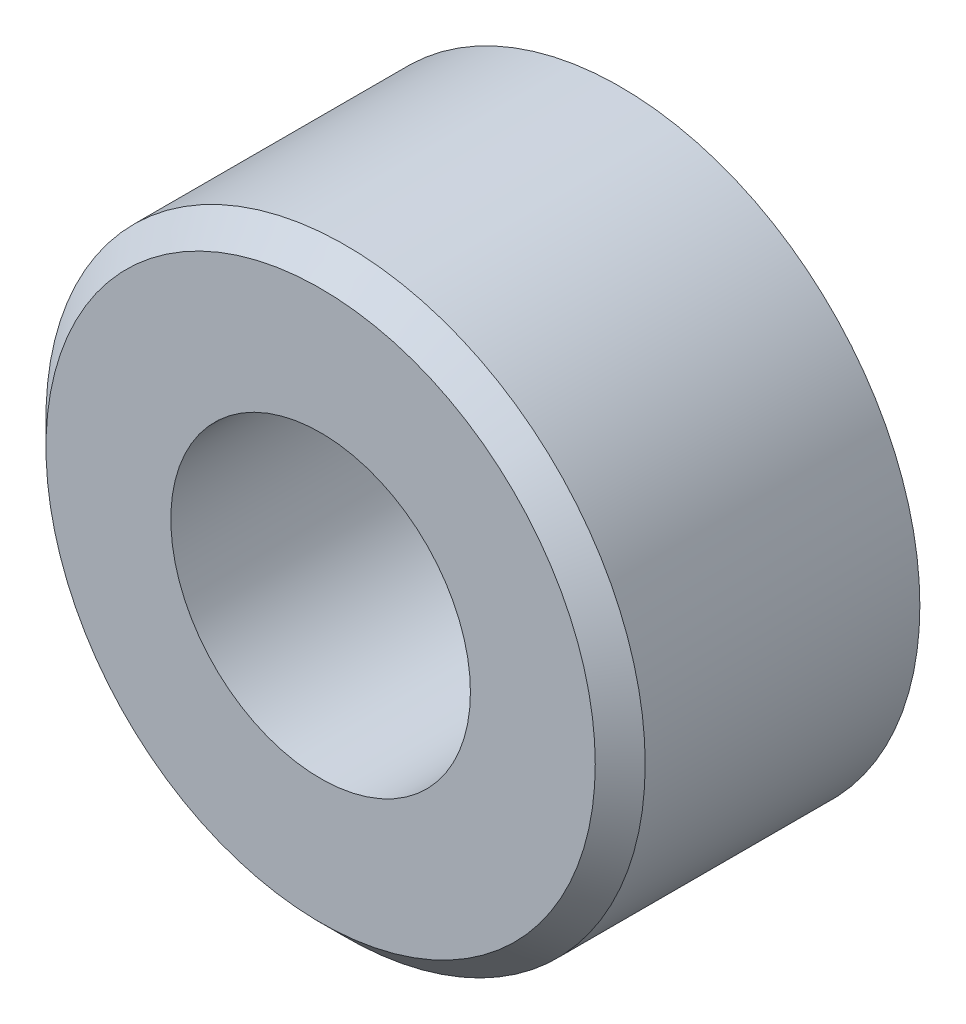
ISO-10303-21;
HEADER;
FILE_DESCRIPTION(('STEP AP214'),'2;1');
FILE_NAME('part.step','',(''),(''),'','','');
FILE_SCHEMA(('AUTOMOTIVE_DESIGN { 1 0 10303 214 1 1 1 1 }'));
ENDSEC;
DATA;
#1=APPLICATION_CONTEXT('core data for automotive mechanical design processes');
#2=APPLICATION_PROTOCOL_DEFINITION('international standard','automotive_design',2000,#1);
#3=PRODUCT_CONTEXT('',#1,'mechanical');
#4=PRODUCT('Part','Part','',(#3));
#5=PRODUCT_RELATED_PRODUCT_CATEGORY('part','',(#4));
#6=PRODUCT_DEFINITION_FORMATION('','',#4);
#7=PRODUCT_DEFINITION_CONTEXT('part definition',#1,'design');
#8=PRODUCT_DEFINITION('design','',#6,#7);
#9=PRODUCT_DEFINITION_SHAPE('','',#8);
#10=(LENGTH_UNIT() NAMED_UNIT(*) SI_UNIT(.MILLI.,.METRE.));
#11=(NAMED_UNIT(*) PLANE_ANGLE_UNIT() SI_UNIT($,.RADIAN.));
#12=(NAMED_UNIT(*) SI_UNIT($,.STERADIAN.) SOLID_ANGLE_UNIT());
#13=UNCERTAINTY_MEASURE_WITH_UNIT(LENGTH_MEASURE(1.E-05),#10,'distance_accuracy_value','');
#14=(GEOMETRIC_REPRESENTATION_CONTEXT(3) GLOBAL_UNCERTAINTY_ASSIGNED_CONTEXT((#13)) GLOBAL_UNIT_ASSIGNED_CONTEXT((#10,
#11,#12)) REPRESENTATION_CONTEXT('',''));
#15=CARTESIAN_POINT('',(0.,0.,0.));
#16=DIRECTION('',(0.,0.,1.));
#17=DIRECTION('',(1.,0.,0.));
#18=AXIS2_PLACEMENT_3D('',#15,#16,#17);
#19=CARTESIAN_POINT('',(0.,0.,6.));
#20=DIRECTION('',(0.,0.,1.));
#21=DIRECTION('',(1.,0.,0.));
#22=AXIS2_PLACEMENT_3D('',#19,#20,#21);
#23=PLANE('',#22);
#24=CARTESIAN_POINT('',(0.,0.,6.));
#25=DIRECTION('',(0.,0.,1.));
#26=DIRECTION('',(1.,0.,0.));
#27=AXIS2_PLACEMENT_3D('',#24,#25,#26);
#28=CIRCLE('',#27,5.5);
#29=CARTESIAN_POINT('',(5.5,0.,6.));
#30=VERTEX_POINT('',#29);
#31=EDGE_CURVE('E37',#30,#30,#28,.T.);
#32=ORIENTED_EDGE('',*,*,#31,.T.);
#33=EDGE_LOOP('',(#32));
#34=FACE_BOUND('',#33,.T.);
#35=CARTESIAN_POINT('',(0.,0.,6.));
#36=DIRECTION('',(0.,0.,1.));
#37=DIRECTION('',(1.,0.,0.));
#38=AXIS2_PLACEMENT_3D('',#35,#36,#37);
#39=CIRCLE('',#38,3.);
#40=CARTESIAN_POINT('',(3.,0.,6.));
#41=VERTEX_POINT('',#40);
#42=EDGE_CURVE('E45',#41,#41,#39,.T.);
#43=ORIENTED_EDGE('',*,*,#42,.F.);
#44=EDGE_LOOP('',(#43));
#45=FACE_BOUND('',#44,.T.);
#46=ADVANCED_FACE('F30',(#34,#45),#23,.T.);
#47=CARTESIAN_POINT('',(0.,0.,0.));
#48=DIRECTION('',(0.,0.,1.));
#49=DIRECTION('',(1.,0.,0.));
#50=AXIS2_PLACEMENT_3D('',#47,#48,#49);
#51=PLANE('',#50);
#52=CARTESIAN_POINT('',(0.,0.,0.));
#53=DIRECTION('',(0.,0.,1.));
#54=DIRECTION('',(1.,0.,0.));
#55=AXIS2_PLACEMENT_3D('',#52,#53,#54);
#56=CIRCLE('',#55,6.);
#57=CARTESIAN_POINT('',(6.,0.,0.));
#58=VERTEX_POINT('',#57);
#59=EDGE_CURVE('E41',#58,#58,#56,.T.);
#60=ORIENTED_EDGE('',*,*,#59,.F.);
#61=EDGE_LOOP('',(#60));
#62=FACE_BOUND('',#61,.T.);
#63=CARTESIAN_POINT('',(0.,0.,0.));
#64=DIRECTION('',(0.,0.,1.));
#65=DIRECTION('',(1.,0.,0.));
#66=AXIS2_PLACEMENT_3D('',#63,#64,#65);
#67=CIRCLE('',#66,3.);
#68=CARTESIAN_POINT('',(3.,0.,0.));
#69=VERTEX_POINT('',#68);
#70=EDGE_CURVE('E48',#69,#69,#67,.T.);
#71=ORIENTED_EDGE('',*,*,#70,.T.);
#72=EDGE_LOOP('',(#71));
#73=FACE_BOUND('',#72,.T.);
#74=ADVANCED_FACE('F58',(#62,#73),#51,.F.);
#75=CARTESIAN_POINT('',(0.,0.,6.));
#76=DIRECTION('',(0.,0.,-1.));
#77=DIRECTION('',(-1.,0.,0.));
#78=AXIS2_PLACEMENT_3D('',#75,#76,#77);
#79=CYLINDRICAL_SURFACE('',#78,6.);
#80=CARTESIAN_POINT('',(0.,0.,5.49999999999999));
#81=DIRECTION('',(0.,0.,1.));
#82=DIRECTION('',(1.,0.,0.));
#83=AXIS2_PLACEMENT_3D('',#80,#81,#82);
#84=CIRCLE('',#83,6.);
#85=CARTESIAN_POINT('',(6.,0.,5.49999999999999));
#86=VERTEX_POINT('',#85);
#87=EDGE_CURVE('E10',#86,#86,#84,.F.);
#88=ORIENTED_EDGE('',*,*,#87,.T.);
#89=EDGE_LOOP('',(#88));
#90=FACE_BOUND('',#89,.T.);
#91=ORIENTED_EDGE('',*,*,#59,.T.);
#92=EDGE_LOOP('',(#91));
#93=FACE_BOUND('',#92,.T.);
#94=ADVANCED_FACE('F63',(#90,#93),#79,.T.);
#95=CARTESIAN_POINT('',(0.,0.,6.));
#96=DIRECTION('',(0.,0.,-1.));
#97=DIRECTION('',(-1.,0.,0.));
#98=AXIS2_PLACEMENT_3D('',#95,#96,#97);
#99=CYLINDRICAL_SURFACE('',#98,3.);
#100=ORIENTED_EDGE('',*,*,#42,.T.);
#101=EDGE_LOOP('',(#100));
#102=FACE_BOUND('',#101,.T.);
#103=ORIENTED_EDGE('',*,*,#70,.F.);
#104=EDGE_LOOP('',(#103));
#105=FACE_BOUND('',#104,.T.);
#106=ADVANCED_FACE('F54',(#102,#105),#99,.F.);
#107=CARTESIAN_POINT('',(0.,0.,6.));
#108=DIRECTION('',(0.,0.,-1.));
#109=DIRECTION('',(-1.,0.,0.));
#110=AXIS2_PLACEMENT_3D('',#107,#108,#109);
#111=CONICAL_SURFACE('',#110,5.5,0.785398163397447);
#112=ORIENTED_EDGE('',*,*,#87,.F.);
#113=EDGE_LOOP('',(#112));
#114=FACE_BOUND('',#113,.T.);
#115=ORIENTED_EDGE('',*,*,#31,.F.);
#116=EDGE_LOOP('',(#115));
#117=FACE_BOUND('',#116,.T.);
#118=ADVANCED_FACE('F32',(#114,#117),#111,.T.);
#119=CLOSED_SHELL('',(#46,#74,#94,#106,#118));
#120=MANIFOLD_SOLID_BREP('B2',#119);
#121=ADVANCED_BREP_SHAPE_REPRESENTATION('',(#18,#120),#14);
#122=SHAPE_DEFINITION_REPRESENTATION(#9,#121);
ENDSEC;
END-ISO-10303-21;
